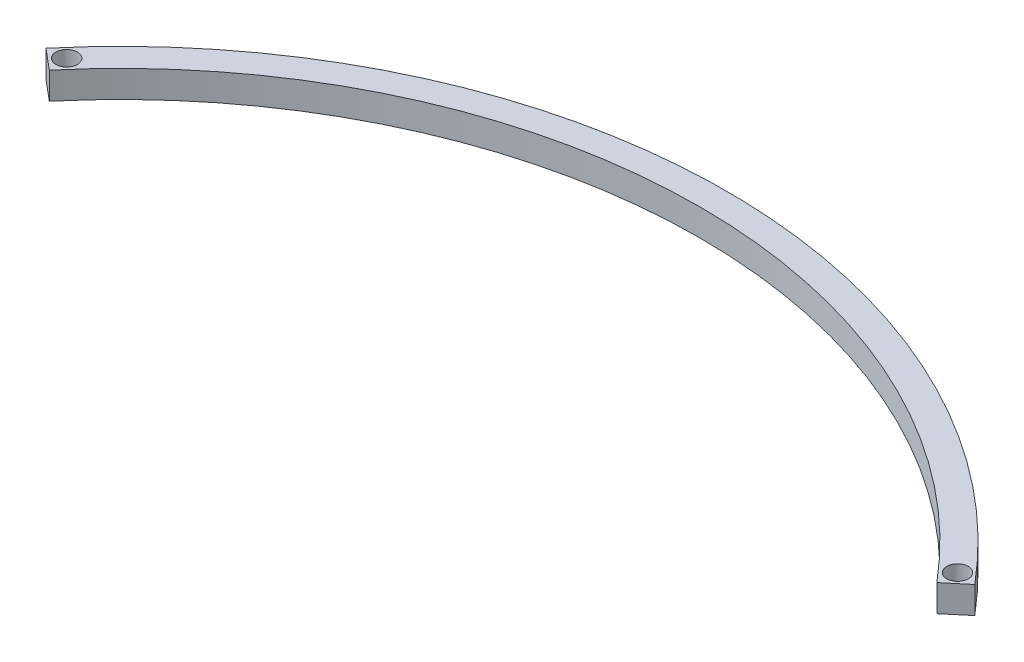
ISO-10303-21;
HEADER;
FILE_DESCRIPTION(('STEP AP214'),'2;1');
FILE_NAME('part.step','',(''),(''),'','','');
FILE_SCHEMA(('AUTOMOTIVE_DESIGN { 1 0 10303 214 1 1 1 1 }'));
ENDSEC;
DATA;
#1=APPLICATION_CONTEXT('core data for automotive mechanical design processes');
#2=APPLICATION_PROTOCOL_DEFINITION('international standard','automotive_design',2000,#1);
#3=PRODUCT_CONTEXT('',#1,'mechanical');
#4=PRODUCT('Part','Part','',(#3));
#5=PRODUCT_RELATED_PRODUCT_CATEGORY('part','',(#4));
#6=PRODUCT_DEFINITION_FORMATION('','',#4);
#7=PRODUCT_DEFINITION_CONTEXT('part definition',#1,'design');
#8=PRODUCT_DEFINITION('design','',#6,#7);
#9=PRODUCT_DEFINITION_SHAPE('','',#8);
#10=(LENGTH_UNIT() NAMED_UNIT(*) SI_UNIT(.MILLI.,.METRE.));
#11=(NAMED_UNIT(*) PLANE_ANGLE_UNIT() SI_UNIT($,.RADIAN.));
#12=(NAMED_UNIT(*) SI_UNIT($,.STERADIAN.) SOLID_ANGLE_UNIT());
#13=UNCERTAINTY_MEASURE_WITH_UNIT(LENGTH_MEASURE(1.E-05),#10,'distance_accuracy_value','');
#14=(GEOMETRIC_REPRESENTATION_CONTEXT(3) GLOBAL_UNCERTAINTY_ASSIGNED_CONTEXT((#13)) GLOBAL_UNIT_ASSIGNED_CONTEXT((#10,
#11,#12)) REPRESENTATION_CONTEXT('',''));
#15=CARTESIAN_POINT('',(0.,0.,0.));
#16=DIRECTION('',(0.,0.,1.));
#17=DIRECTION('',(1.,0.,0.));
#18=AXIS2_PLACEMENT_3D('',#15,#16,#17);
#19=CARTESIAN_POINT('',(0.,5.,0.));
#20=DIRECTION('',(0.,-1.,0.));
#21=DIRECTION('',(0.,0.,-1.));
#22=AXIS2_PLACEMENT_3D('',#19,#20,#21);
#23=PLANE('',#22);
#24=CARTESIAN_POINT('',(0.,5.,0.));
#25=DIRECTION('',(0.,1.,0.));
#26=DIRECTION('',(0.,0.,-1.));
#27=AXIS2_PLACEMENT_3D('',#24,#25,#26);
#28=CIRCLE('',#27,225.);
#29=CARTESIAN_POINT('',(172.35999970177,5.,-144.627212179472));
#30=VERTEX_POINT('',#29);
#31=CARTESIAN_POINT('',(-172.35999970177,5.,-144.627212179472));
#32=VERTEX_POINT('',#31);
#33=EDGE_CURVE('E96',#30,#32,#28,.T.);
#34=ORIENTED_EDGE('',*,*,#33,.T.);
#35=DIRECTION('',(0.766044443118975,0.,0.642787609686543));
#36=VECTOR('',#35,1.);
#37=CARTESIAN_POINT('',(-172.35999970177,5.,-144.627212179472));
#38=LINE('',#37,#36);
#39=CARTESIAN_POINT('',(-164.69955527058,5.,-138.199336082606));
#40=VERTEX_POINT('',#39);
#41=EDGE_CURVE('E91',#32,#40,#38,.T.);
#42=ORIENTED_EDGE('',*,*,#41,.T.);
#43=CARTESIAN_POINT('',(0.,5.,0.));
#44=DIRECTION('',(0.,-1.,0.));
#45=DIRECTION('',(0.,0.,-1.));
#46=AXIS2_PLACEMENT_3D('',#43,#44,#45);
#47=CIRCLE('',#46,215.);
#48=CARTESIAN_POINT('',(164.69955527058,5.,-138.199336082606));
#49=VERTEX_POINT('',#48);
#50=EDGE_CURVE('E94',#40,#49,#47,.T.);
#51=ORIENTED_EDGE('',*,*,#50,.T.);
#52=DIRECTION('',(0.766044443118975,0.,-0.642787609686543));
#53=VECTOR('',#52,1.);
#54=CARTESIAN_POINT('',(172.35999970177,5.,-144.627212179472));
#55=LINE('',#54,#53);
#56=EDGE_CURVE('E61',#49,#30,#55,.T.);
#57=ORIENTED_EDGE('',*,*,#56,.T.);
#58=EDGE_LOOP('',(#34,#42,#51,#57));
#59=FACE_BOUND('',#58,.T.);
#60=CARTESIAN_POINT('',(-165.315839437742,5.,-145.243496346634));
#61=DIRECTION('',(0.,1.,0.));
#62=DIRECTION('',(0.,0.,1.));
#63=AXIS2_PLACEMENT_3D('',#60,#61,#62);
#64=CIRCLE('',#63,3.99999999999999);
#65=CARTESIAN_POINT('',(-165.315839437742,5.,-141.243496346634));
#66=VERTEX_POINT('',#65);
#67=EDGE_CURVE('E116',#66,#66,#64,.T.);
#68=ORIENTED_EDGE('',*,*,#67,.F.);
#69=EDGE_LOOP('',(#68));
#70=FACE_BOUND('',#69,.T.);
#71=CARTESIAN_POINT('',(165.315839437742,5.,-145.243496346634));
#72=DIRECTION('',(0.,1.,0.));
#73=DIRECTION('',(0.,0.,-1.));
#74=AXIS2_PLACEMENT_3D('',#71,#72,#73);
#75=CIRCLE('',#74,3.99999999999999);
#76=CARTESIAN_POINT('',(165.315839437742,5.,-149.243496346634));
#77=VERTEX_POINT('',#76);
#78=EDGE_CURVE('E138',#77,#77,#75,.T.);
#79=ORIENTED_EDGE('',*,*,#78,.F.);
#80=EDGE_LOOP('',(#79));
#81=FACE_BOUND('',#80,.T.);
#82=ADVANCED_FACE('F43',(#59,#70,#81),#23,.F.);
#83=CARTESIAN_POINT('',(0.,-5.,0.));
#84=DIRECTION('',(0.,-1.,0.));
#85=DIRECTION('',(0.,0.,-1.));
#86=AXIS2_PLACEMENT_3D('',#83,#84,#85);
#87=PLANE('',#86);
#88=CARTESIAN_POINT('',(-165.315839437742,-5.,-145.243496346634));
#89=DIRECTION('',(0.,1.,0.));
#90=DIRECTION('',(0.,0.,1.));
#91=AXIS2_PLACEMENT_3D('',#88,#89,#90);
#92=CIRCLE('',#91,3.99999999999999);
#93=CARTESIAN_POINT('',(-165.315839437742,-5.,-141.243496346634));
#94=VERTEX_POINT('',#93);
#95=EDGE_CURVE('E134',#94,#94,#92,.T.);
#96=ORIENTED_EDGE('',*,*,#95,.T.);
#97=EDGE_LOOP('',(#96));
#98=FACE_BOUND('',#97,.T.);
#99=CARTESIAN_POINT('',(0.,-5.,0.));
#100=DIRECTION('',(0.,1.,0.));
#101=DIRECTION('',(0.,0.,-1.));
#102=AXIS2_PLACEMENT_3D('',#99,#100,#101);
#103=CIRCLE('',#102,225.);
#104=CARTESIAN_POINT('',(172.35999970177,-5.,-144.627212179472));
#105=VERTEX_POINT('',#104);
#106=CARTESIAN_POINT('',(-172.35999970177,-5.,-144.627212179472));
#107=VERTEX_POINT('',#106);
#108=EDGE_CURVE('E112',#105,#107,#103,.T.);
#109=ORIENTED_EDGE('',*,*,#108,.F.);
#110=DIRECTION('',(0.766044443118975,0.,-0.642787609686543));
#111=VECTOR('',#110,1.);
#112=CARTESIAN_POINT('',(172.35999970177,-5.,-144.627212179472));
#113=LINE('',#112,#111);
#114=CARTESIAN_POINT('',(164.69955527058,-5.,-138.199336082606));
#115=VERTEX_POINT('',#114);
#116=EDGE_CURVE('E84',#115,#105,#113,.T.);
#117=ORIENTED_EDGE('',*,*,#116,.F.);
#118=CARTESIAN_POINT('',(0.,-5.,0.));
#119=DIRECTION('',(0.,-1.,0.));
#120=DIRECTION('',(0.,0.,-1.));
#121=AXIS2_PLACEMENT_3D('',#118,#119,#120);
#122=CIRCLE('',#121,215.);
#123=CARTESIAN_POINT('',(-164.69955527058,-5.,-138.199336082606));
#124=VERTEX_POINT('',#123);
#125=EDGE_CURVE('E78',#124,#115,#122,.T.);
#126=ORIENTED_EDGE('',*,*,#125,.F.);
#127=DIRECTION('',(0.766044443118975,0.,0.642787609686543));
#128=VECTOR('',#127,1.);
#129=CARTESIAN_POINT('',(-172.35999970177,-5.,-144.627212179472));
#130=LINE('',#129,#128);
#131=EDGE_CURVE('E101',#107,#124,#130,.T.);
#132=ORIENTED_EDGE('',*,*,#131,.F.);
#133=EDGE_LOOP('',(#109,#117,#126,#132));
#134=FACE_BOUND('',#133,.T.);
#135=CARTESIAN_POINT('',(165.315839437742,-5.,-145.243496346634));
#136=DIRECTION('',(0.,1.,0.));
#137=DIRECTION('',(0.,0.,-1.));
#138=AXIS2_PLACEMENT_3D('',#135,#136,#137);
#139=CIRCLE('',#138,3.99999999999999);
#140=CARTESIAN_POINT('',(165.315839437742,-5.,-149.243496346634));
#141=VERTEX_POINT('',#140);
#142=EDGE_CURVE('E142',#141,#141,#139,.T.);
#143=ORIENTED_EDGE('',*,*,#142,.T.);
#144=EDGE_LOOP('',(#143));
#145=FACE_BOUND('',#144,.T.);
#146=ADVANCED_FACE('F129',(#98,#134,#145),#87,.T.);
#147=CARTESIAN_POINT('',(0.,5.,0.));
#148=DIRECTION('',(0.,-1.,0.));
#149=DIRECTION('',(0.,0.,-1.));
#150=AXIS2_PLACEMENT_3D('',#147,#148,#149);
#151=CYLINDRICAL_SURFACE('',#150,225.);
#152=ORIENTED_EDGE('',*,*,#108,.T.);
#153=DIRECTION('',(0.,-1.,0.));
#154=VECTOR('',#153,1.);
#155=CARTESIAN_POINT('',(-172.35999970177,5.,-144.627212179472));
#156=LINE('',#155,#154);
#157=EDGE_CURVE('E11',#32,#107,#156,.T.);
#158=ORIENTED_EDGE('',*,*,#157,.F.);
#159=ORIENTED_EDGE('',*,*,#33,.F.);
#160=DIRECTION('',(0.,-1.,0.));
#161=VECTOR('',#160,1.);
#162=CARTESIAN_POINT('',(172.35999970177,5.,-144.627212179472));
#163=LINE('',#162,#161);
#164=EDGE_CURVE('E108',#30,#105,#163,.T.);
#165=ORIENTED_EDGE('',*,*,#164,.T.);
#166=EDGE_LOOP('',(#152,#158,#159,#165));
#167=FACE_BOUND('',#166,.T.);
#168=ADVANCED_FACE('F45',(#167),#151,.T.);
#169=CARTESIAN_POINT('',(-172.35999970177,5.,-144.627212179472));
#170=DIRECTION('',(0.642787609686542,0.,-0.766044443118975));
#171=DIRECTION('',(-0.766044443118976,0.,-0.642787609686543));
#172=AXIS2_PLACEMENT_3D('',#169,#170,#171);
#173=PLANE('',#172);
#174=ORIENTED_EDGE('',*,*,#131,.T.);
#175=DIRECTION('',(0.,-1.,0.));
#176=VECTOR('',#175,1.);
#177=CARTESIAN_POINT('',(-164.69955527058,5.,-138.199336082606));
#178=LINE('',#177,#176);
#179=EDGE_CURVE('E53',#40,#124,#178,.T.);
#180=ORIENTED_EDGE('',*,*,#179,.F.);
#181=ORIENTED_EDGE('',*,*,#41,.F.);
#182=ORIENTED_EDGE('',*,*,#157,.T.);
#183=EDGE_LOOP('',(#174,#180,#181,#182));
#184=FACE_BOUND('',#183,.T.);
#185=ADVANCED_FACE('F100',(#184),#173,.F.);
#186=CARTESIAN_POINT('',(0.,5.,0.));
#187=DIRECTION('',(0.,-1.,0.));
#188=DIRECTION('',(0.,0.,-1.));
#189=AXIS2_PLACEMENT_3D('',#186,#187,#188);
#190=CYLINDRICAL_SURFACE('',#189,215.);
#191=ORIENTED_EDGE('',*,*,#125,.T.);
#192=DIRECTION('',(0.,-1.,0.));
#193=VECTOR('',#192,1.);
#194=CARTESIAN_POINT('',(164.69955527058,5.,-138.199336082606));
#195=LINE('',#194,#193);
#196=EDGE_CURVE('E103',#49,#115,#195,.T.);
#197=ORIENTED_EDGE('',*,*,#196,.F.);
#198=ORIENTED_EDGE('',*,*,#50,.F.);
#199=ORIENTED_EDGE('',*,*,#179,.T.);
#200=EDGE_LOOP('',(#191,#197,#198,#199));
#201=FACE_BOUND('',#200,.T.);
#202=ADVANCED_FACE('F104',(#201),#190,.F.);
#203=CARTESIAN_POINT('',(172.35999970177,5.,-144.627212179472));
#204=DIRECTION('',(-0.642787609686542,0.,-0.766044443118975));
#205=DIRECTION('',(-0.766044443118976,0.,0.642787609686543));
#206=AXIS2_PLACEMENT_3D('',#203,#204,#205);
#207=PLANE('',#206);
#208=ORIENTED_EDGE('',*,*,#116,.T.);
#209=ORIENTED_EDGE('',*,*,#164,.F.);
#210=ORIENTED_EDGE('',*,*,#56,.F.);
#211=ORIENTED_EDGE('',*,*,#196,.T.);
#212=EDGE_LOOP('',(#208,#209,#210,#211));
#213=FACE_BOUND('',#212,.T.);
#214=ADVANCED_FACE('F126',(#213),#207,.F.);
#215=CARTESIAN_POINT('',(-165.315839437742,5.,-145.243496346634));
#216=DIRECTION('',(0.,-1.,0.));
#217=DIRECTION('',(0.,0.,-1.));
#218=AXIS2_PLACEMENT_3D('',#215,#216,#217);
#219=CYLINDRICAL_SURFACE('',#218,3.99999999999999);
#220=ORIENTED_EDGE('',*,*,#67,.T.);
#221=EDGE_LOOP('',(#220));
#222=FACE_BOUND('',#221,.T.);
#223=ORIENTED_EDGE('',*,*,#95,.F.);
#224=EDGE_LOOP('',(#223));
#225=FACE_BOUND('',#224,.T.);
#226=ADVANCED_FACE('F161',(#222,#225),#219,.F.);
#227=CARTESIAN_POINT('',(165.315839437742,5.,-145.243496346634));
#228=DIRECTION('',(0.,-1.,0.));
#229=DIRECTION('',(0.,0.,-1.));
#230=AXIS2_PLACEMENT_3D('',#227,#228,#229);
#231=CYLINDRICAL_SURFACE('',#230,3.99999999999999);
#232=ORIENTED_EDGE('',*,*,#78,.T.);
#233=EDGE_LOOP('',(#232));
#234=FACE_BOUND('',#233,.T.);
#235=ORIENTED_EDGE('',*,*,#142,.F.);
#236=EDGE_LOOP('',(#235));
#237=FACE_BOUND('',#236,.T.);
#238=ADVANCED_FACE('F150',(#234,#237),#231,.F.);
#239=CLOSED_SHELL('',(#82,#146,#168,#185,#202,#214,#226,#238));
#240=MANIFOLD_SOLID_BREP('B2',#239);
#241=ADVANCED_BREP_SHAPE_REPRESENTATION('',(#18,#240),#14);
#242=SHAPE_DEFINITION_REPRESENTATION(#9,#241);
ENDSEC;
END-ISO-10303-21;
